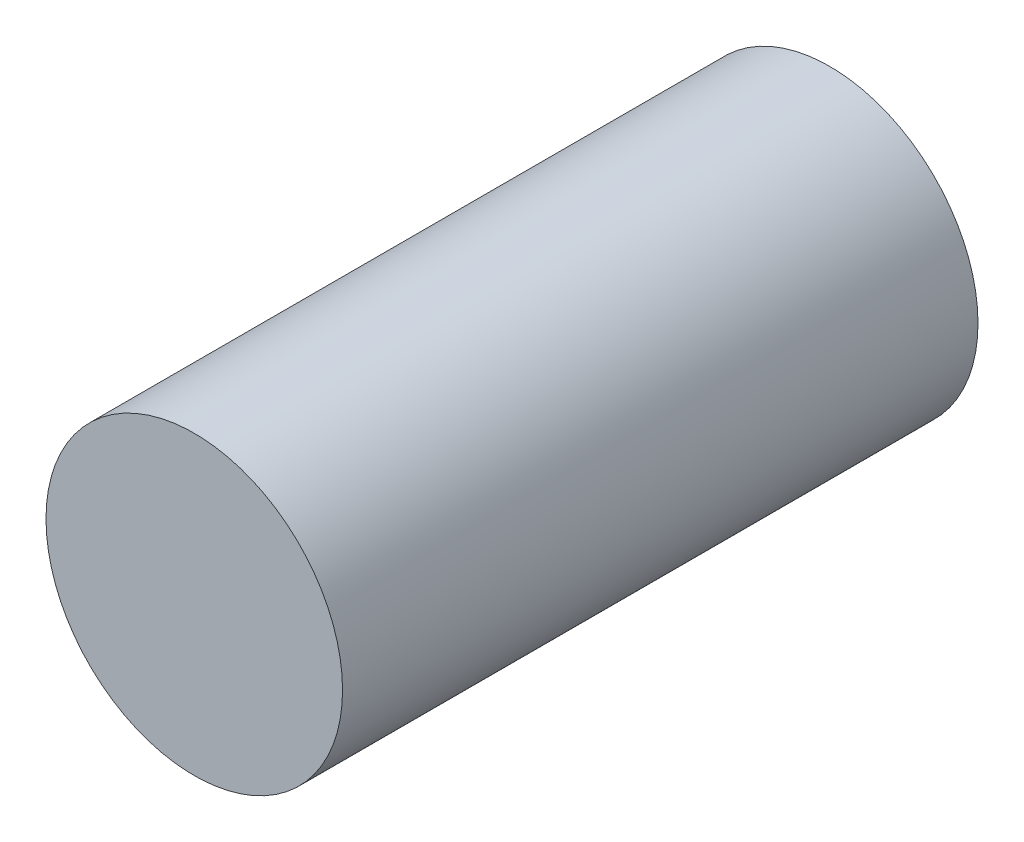
ISO-10303-21;
HEADER;
FILE_DESCRIPTION(('STEP AP214'),'2;1');
FILE_NAME('part.step','',(''),(''),'','','');
FILE_SCHEMA(('AUTOMOTIVE_DESIGN { 1 0 10303 214 1 1 1 1 }'));
ENDSEC;
DATA;
#1=APPLICATION_CONTEXT('core data for automotive mechanical design processes');
#2=APPLICATION_PROTOCOL_DEFINITION('international standard','automotive_design',2000,#1);
#3=PRODUCT_CONTEXT('',#1,'mechanical');
#4=PRODUCT('Part','Part','',(#3));
#5=PRODUCT_RELATED_PRODUCT_CATEGORY('part','',(#4));
#6=PRODUCT_DEFINITION_FORMATION('','',#4);
#7=PRODUCT_DEFINITION_CONTEXT('part definition',#1,'design');
#8=PRODUCT_DEFINITION('design','',#6,#7);
#9=PRODUCT_DEFINITION_SHAPE('','',#8);
#10=(LENGTH_UNIT() NAMED_UNIT(*) SI_UNIT(.MILLI.,.METRE.));
#11=(NAMED_UNIT(*) PLANE_ANGLE_UNIT() SI_UNIT($,.RADIAN.));
#12=(NAMED_UNIT(*) SI_UNIT($,.STERADIAN.) SOLID_ANGLE_UNIT());
#13=UNCERTAINTY_MEASURE_WITH_UNIT(LENGTH_MEASURE(1.E-05),#10,'distance_accuracy_value','');
#14=(GEOMETRIC_REPRESENTATION_CONTEXT(3) GLOBAL_UNCERTAINTY_ASSIGNED_CONTEXT((#13)) GLOBAL_UNIT_ASSIGNED_CONTEXT((#10,
#11,#12)) REPRESENTATION_CONTEXT('',''));
#15=CARTESIAN_POINT('',(0.,0.,0.));
#16=DIRECTION('',(0.,0.,1.));
#17=DIRECTION('',(1.,0.,0.));
#18=AXIS2_PLACEMENT_3D('',#15,#16,#17);
#19=CARTESIAN_POINT('',(-11.5853681530454,17.5649130062301,30.));
#20=DIRECTION('',(0.,0.,-1.));
#21=DIRECTION('',(-1.,0.,0.));
#22=AXIS2_PLACEMENT_3D('',#19,#20,#21);
#23=CYLINDRICAL_SURFACE('',#22,7.);
#24=CARTESIAN_POINT('',(-11.5853681530454,17.5649130062301,30.));
#25=DIRECTION('',(0.,0.,1.));
#26=DIRECTION('',(1.,0.,0.));
#27=AXIS2_PLACEMENT_3D('',#24,#25,#26);
#28=CIRCLE('',#27,7.);
#29=CARTESIAN_POINT('',(-4.58536815304539,17.5649130062301,30.));
#30=VERTEX_POINT('',#29);
#31=EDGE_CURVE('E10',#30,#30,#28,.T.);
#32=ORIENTED_EDGE('',*,*,#31,.F.);
#33=EDGE_LOOP('',(#32));
#34=FACE_BOUND('',#33,.T.);
#35=CARTESIAN_POINT('',(-11.5853681530454,17.5649130062301,0.));
#36=DIRECTION('',(0.,0.,1.));
#37=DIRECTION('',(1.,0.,0.));
#38=AXIS2_PLACEMENT_3D('',#35,#36,#37);
#39=CIRCLE('',#38,7.);
#40=CARTESIAN_POINT('',(-4.58536815304539,17.5649130062301,0.));
#41=VERTEX_POINT('',#40);
#42=EDGE_CURVE('E36',#41,#41,#39,.T.);
#43=ORIENTED_EDGE('',*,*,#42,.T.);
#44=EDGE_LOOP('',(#43));
#45=FACE_BOUND('',#44,.T.);
#46=ADVANCED_FACE('F33',(#34,#45),#23,.T.);
#47=CARTESIAN_POINT('',(-11.5853681530454,17.5649130062301,30.));
#48=DIRECTION('',(0.,0.,1.));
#49=DIRECTION('',(1.,0.,0.));
#50=AXIS2_PLACEMENT_3D('',#47,#48,#49);
#51=PLANE('',#50);
#52=ORIENTED_EDGE('',*,*,#31,.T.);
#53=EDGE_LOOP('',(#52));
#54=FACE_BOUND('',#53,.T.);
#55=ADVANCED_FACE('F48',(#54),#51,.T.);
#56=CARTESIAN_POINT('',(-11.5853681530454,17.5649130062301,0.));
#57=DIRECTION('',(0.,0.,1.));
#58=DIRECTION('',(1.,0.,0.));
#59=AXIS2_PLACEMENT_3D('',#56,#57,#58);
#60=PLANE('',#59);
#61=ORIENTED_EDGE('',*,*,#42,.F.);
#62=EDGE_LOOP('',(#61));
#63=FACE_BOUND('',#62,.T.);
#64=ADVANCED_FACE('F46',(#63),#60,.F.);
#65=CLOSED_SHELL('',(#46,#55,#64));
#66=MANIFOLD_SOLID_BREP('B2',#65);
#67=ADVANCED_BREP_SHAPE_REPRESENTATION('',(#18,#66),#14);
#68=SHAPE_DEFINITION_REPRESENTATION(#9,#67);
ENDSEC;
END-ISO-10303-21;
